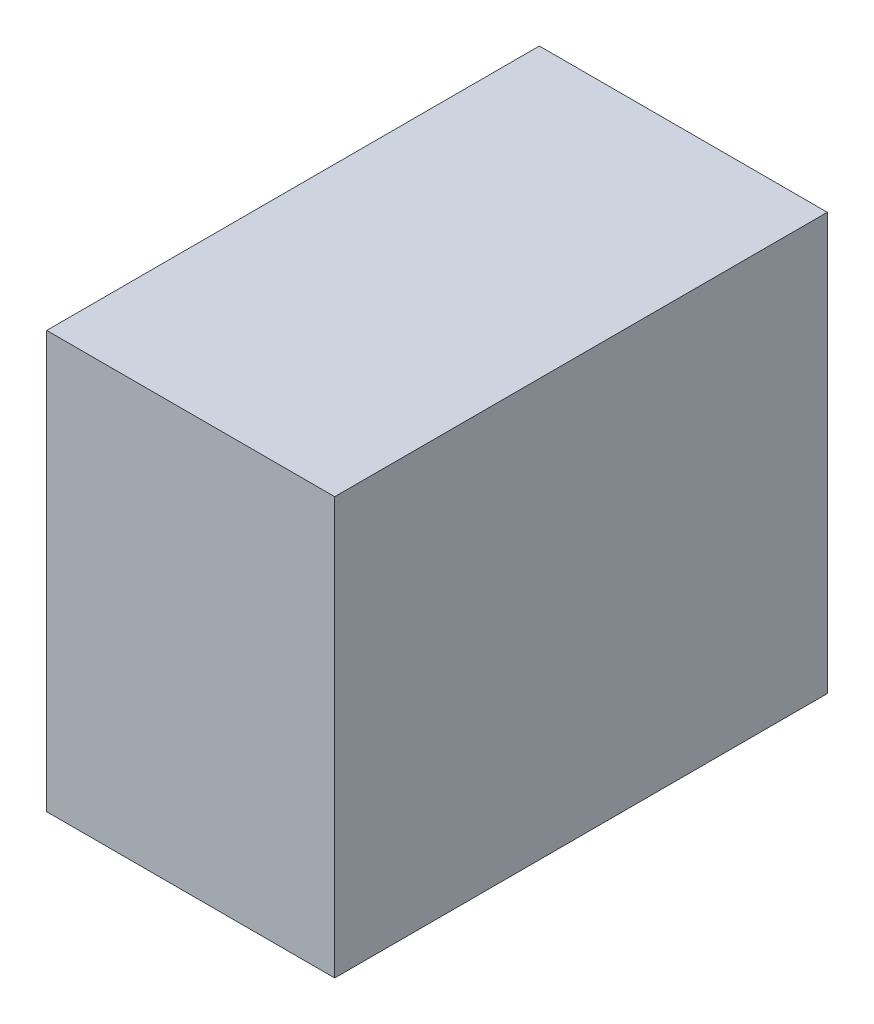
ISO-10303-21;
HEADER;
FILE_DESCRIPTION(('STEP AP214'),'2;1');
FILE_NAME('part.step','',(''),(''),'','','');
FILE_SCHEMA(('AUTOMOTIVE_DESIGN { 1 0 10303 214 1 1 1 1 }'));
ENDSEC;
DATA;
#1=APPLICATION_CONTEXT('core data for automotive mechanical design processes');
#2=APPLICATION_PROTOCOL_DEFINITION('international standard','automotive_design',2000,#1);
#3=PRODUCT_CONTEXT('',#1,'mechanical');
#4=PRODUCT('Part','Part','',(#3));
#5=PRODUCT_RELATED_PRODUCT_CATEGORY('part','',(#4));
#6=PRODUCT_DEFINITION_FORMATION('','',#4);
#7=PRODUCT_DEFINITION_CONTEXT('part definition',#1,'design');
#8=PRODUCT_DEFINITION('design','',#6,#7);
#9=PRODUCT_DEFINITION_SHAPE('','',#8);
#10=(LENGTH_UNIT() NAMED_UNIT(*) SI_UNIT(.MILLI.,.METRE.));
#11=(NAMED_UNIT(*) PLANE_ANGLE_UNIT() SI_UNIT($,.RADIAN.));
#12=(NAMED_UNIT(*) SI_UNIT($,.STERADIAN.) SOLID_ANGLE_UNIT());
#13=UNCERTAINTY_MEASURE_WITH_UNIT(LENGTH_MEASURE(1.E-05),#10,'distance_accuracy_value','');
#14=(GEOMETRIC_REPRESENTATION_CONTEXT(3) GLOBAL_UNCERTAINTY_ASSIGNED_CONTEXT((#13)) GLOBAL_UNIT_ASSIGNED_CONTEXT((#10,
#11,#12)) REPRESENTATION_CONTEXT('',''));
#15=CARTESIAN_POINT('',(0.,0.,0.));
#16=DIRECTION('',(0.,0.,1.));
#17=DIRECTION('',(1.,0.,0.));
#18=AXIS2_PLACEMENT_3D('',#15,#16,#17);
#19=CARTESIAN_POINT('',(-48.2600000000002,69.8499999999998,-82.55));
#20=DIRECTION('',(0.,-1.,0.));
#21=DIRECTION('',(0.,0.,1.));
#22=AXIS2_PLACEMENT_3D('',#19,#20,#21);
#23=PLANE('',#22);
#24=DIRECTION('',(0.,0.,-1.));
#25=VECTOR('',#24,1.);
#26=CARTESIAN_POINT('',(48.2599999999997,69.8500000000001,-82.55));
#27=LINE('',#26,#25);
#28=CARTESIAN_POINT('',(48.2599999999997,69.8500000000002,82.55));
#29=VERTEX_POINT('',#28);
#30=CARTESIAN_POINT('',(48.2599999999997,69.8500000000001,-82.55));
#31=VERTEX_POINT('',#30);
#32=EDGE_CURVE('E107',#29,#31,#27,.T.);
#33=ORIENTED_EDGE('',*,*,#32,.T.);
#34=DIRECTION('',(1.,0.,0.));
#35=VECTOR('',#34,1.);
#36=CARTESIAN_POINT('',(-48.2600000000002,69.8499999999998,-82.55));
#37=LINE('',#36,#35);
#38=CARTESIAN_POINT('',(-48.2600000000002,69.8499999999998,-82.55));
#39=VERTEX_POINT('',#38);
#40=EDGE_CURVE('E11',#39,#31,#37,.T.);
#41=ORIENTED_EDGE('',*,*,#40,.F.);
#42=DIRECTION('',(0.,0.,-1.));
#43=VECTOR('',#42,1.);
#44=CARTESIAN_POINT('',(-48.2600000000002,69.8499999999998,-82.55));
#45=LINE('',#44,#43);
#46=CARTESIAN_POINT('',(-48.2600000000002,69.8499999999998,82.55));
#47=VERTEX_POINT('',#46);
#48=EDGE_CURVE('E91',#47,#39,#45,.T.);
#49=ORIENTED_EDGE('',*,*,#48,.F.);
#50=DIRECTION('',(1.,0.,0.));
#51=VECTOR('',#50,1.);
#52=CARTESIAN_POINT('',(-48.2600000000002,69.8499999999998,82.55));
#53=LINE('',#52,#51);
#54=EDGE_CURVE('E103',#47,#29,#53,.T.);
#55=ORIENTED_EDGE('',*,*,#54,.T.);
#56=EDGE_LOOP('',(#33,#41,#49,#55));
#57=FACE_BOUND('',#56,.T.);
#58=ADVANCED_FACE('F39',(#57),#23,.F.);
#59=CARTESIAN_POINT('',(-48.2599999999997,-69.8500000000002,-82.55));
#60=DIRECTION('',(0.,0.,1.));
#61=DIRECTION('',(0.,1.,0.));
#62=AXIS2_PLACEMENT_3D('',#59,#60,#61);
#63=PLANE('',#62);
#64=DIRECTION('',(0.,-1.,0.));
#65=VECTOR('',#64,1.);
#66=CARTESIAN_POINT('',(48.2600000000002,-69.8499999999999,-82.55));
#67=LINE('',#66,#65);
#68=CARTESIAN_POINT('',(48.2600000000002,-69.8499999999999,-82.55));
#69=VERTEX_POINT('',#68);
#70=EDGE_CURVE('E96',#31,#69,#67,.T.);
#71=ORIENTED_EDGE('',*,*,#70,.T.);
#72=DIRECTION('',(1.,0.,0.));
#73=VECTOR('',#72,1.);
#74=CARTESIAN_POINT('',(-48.2599999999997,-69.8500000000002,-82.55));
#75=LINE('',#74,#73);
#76=CARTESIAN_POINT('',(-48.2599999999997,-69.8500000000002,-82.55));
#77=VERTEX_POINT('',#76);
#78=EDGE_CURVE('E48',#77,#69,#75,.T.);
#79=ORIENTED_EDGE('',*,*,#78,.F.);
#80=DIRECTION('',(0.,-1.,0.));
#81=VECTOR('',#80,1.);
#82=CARTESIAN_POINT('',(-48.2599999999997,-69.8500000000002,-82.55));
#83=LINE('',#82,#81);
#84=EDGE_CURVE('E86',#39,#77,#83,.T.);
#85=ORIENTED_EDGE('',*,*,#84,.F.);
#86=ORIENTED_EDGE('',*,*,#40,.T.);
#87=EDGE_LOOP('',(#71,#79,#85,#86));
#88=FACE_BOUND('',#87,.T.);
#89=ADVANCED_FACE('F95',(#88),#63,.F.);
#90=CARTESIAN_POINT('',(-48.2599999999997,-69.8500000000002,-82.55));
#91=DIRECTION('',(0.,1.,0.));
#92=DIRECTION('',(0.,0.,-1.));
#93=AXIS2_PLACEMENT_3D('',#90,#91,#92);
#94=PLANE('',#93);
#95=DIRECTION('',(0.,0.,1.));
#96=VECTOR('',#95,1.);
#97=CARTESIAN_POINT('',(48.2600000000002,-69.8499999999999,-82.55));
#98=LINE('',#97,#96);
#99=CARTESIAN_POINT('',(48.2600000000002,-69.8499999999998,82.55));
#100=VERTEX_POINT('',#99);
#101=EDGE_CURVE('E73',#69,#100,#98,.T.);
#102=ORIENTED_EDGE('',*,*,#101,.T.);
#103=DIRECTION('',(1.,0.,0.));
#104=VECTOR('',#103,1.);
#105=CARTESIAN_POINT('',(-48.2599999999997,-69.8500000000002,82.55));
#106=LINE('',#105,#104);
#107=CARTESIAN_POINT('',(-48.2599999999997,-69.8500000000002,82.55));
#108=VERTEX_POINT('',#107);
#109=EDGE_CURVE('E98',#108,#100,#106,.T.);
#110=ORIENTED_EDGE('',*,*,#109,.F.);
#111=DIRECTION('',(0.,0.,1.));
#112=VECTOR('',#111,1.);
#113=CARTESIAN_POINT('',(-48.2599999999997,-69.8500000000002,-82.55));
#114=LINE('',#113,#112);
#115=EDGE_CURVE('E89',#77,#108,#114,.T.);
#116=ORIENTED_EDGE('',*,*,#115,.F.);
#117=ORIENTED_EDGE('',*,*,#78,.T.);
#118=EDGE_LOOP('',(#102,#110,#116,#117));
#119=FACE_BOUND('',#118,.T.);
#120=ADVANCED_FACE('F99',(#119),#94,.F.);
#121=CARTESIAN_POINT('',(-48.2599999999997,-69.8500000000002,82.55));
#122=DIRECTION('',(0.,0.,-1.));
#123=DIRECTION('',(0.,-1.,0.));
#124=AXIS2_PLACEMENT_3D('',#121,#122,#123);
#125=PLANE('',#124);
#126=DIRECTION('',(0.,1.,0.));
#127=VECTOR('',#126,1.);
#128=CARTESIAN_POINT('',(48.2600000000002,-69.8499999999998,82.55));
#129=LINE('',#128,#127);
#130=EDGE_CURVE('E79',#100,#29,#129,.T.);
#131=ORIENTED_EDGE('',*,*,#130,.T.);
#132=ORIENTED_EDGE('',*,*,#54,.F.);
#133=DIRECTION('',(0.,1.,0.));
#134=VECTOR('',#133,1.);
#135=CARTESIAN_POINT('',(-48.2599999999997,-69.8500000000002,82.55));
#136=LINE('',#135,#134);
#137=EDGE_CURVE('E56',#108,#47,#136,.T.);
#138=ORIENTED_EDGE('',*,*,#137,.F.);
#139=ORIENTED_EDGE('',*,*,#109,.T.);
#140=EDGE_LOOP('',(#131,#132,#138,#139));
#141=FACE_BOUND('',#140,.T.);
#142=ADVANCED_FACE('F120',(#141),#125,.F.);
#143=CARTESIAN_POINT('',(-48.26,-1.71453962138912E-13,0.));
#144=DIRECTION('',(-1.,0.,0.));
#145=DIRECTION('',(0.,0.,1.));
#146=AXIS2_PLACEMENT_3D('',#143,#144,#145);
#147=PLANE('',#146);
#148=ORIENTED_EDGE('',*,*,#48,.T.);
#149=ORIENTED_EDGE('',*,*,#84,.T.);
#150=ORIENTED_EDGE('',*,*,#115,.T.);
#151=ORIENTED_EDGE('',*,*,#137,.T.);
#152=EDGE_LOOP('',(#148,#149,#150,#151));
#153=FACE_BOUND('',#152,.T.);
#154=ADVANCED_FACE('F87',(#153),#147,.T.);
#155=CARTESIAN_POINT('',(48.26,1.71453962138912E-13,0.));
#156=DIRECTION('',(-1.,0.,0.));
#157=DIRECTION('',(0.,0.,1.));
#158=AXIS2_PLACEMENT_3D('',#155,#156,#157);
#159=PLANE('',#158);
#160=ORIENTED_EDGE('',*,*,#32,.F.);
#161=ORIENTED_EDGE('',*,*,#130,.F.);
#162=ORIENTED_EDGE('',*,*,#101,.F.);
#163=ORIENTED_EDGE('',*,*,#70,.F.);
#164=EDGE_LOOP('',(#160,#161,#162,#163));
#165=FACE_BOUND('',#164,.T.);
#166=ADVANCED_FACE('F123',(#165),#159,.F.);
#167=CLOSED_SHELL('',(#58,#89,#120,#142,#154,#166));
#168=MANIFOLD_SOLID_BREP('B2',#167);
#169=ADVANCED_BREP_SHAPE_REPRESENTATION('',(#18,#168),#14);
#170=SHAPE_DEFINITION_REPRESENTATION(#9,#169);
ENDSEC;
END-ISO-10303-21;
